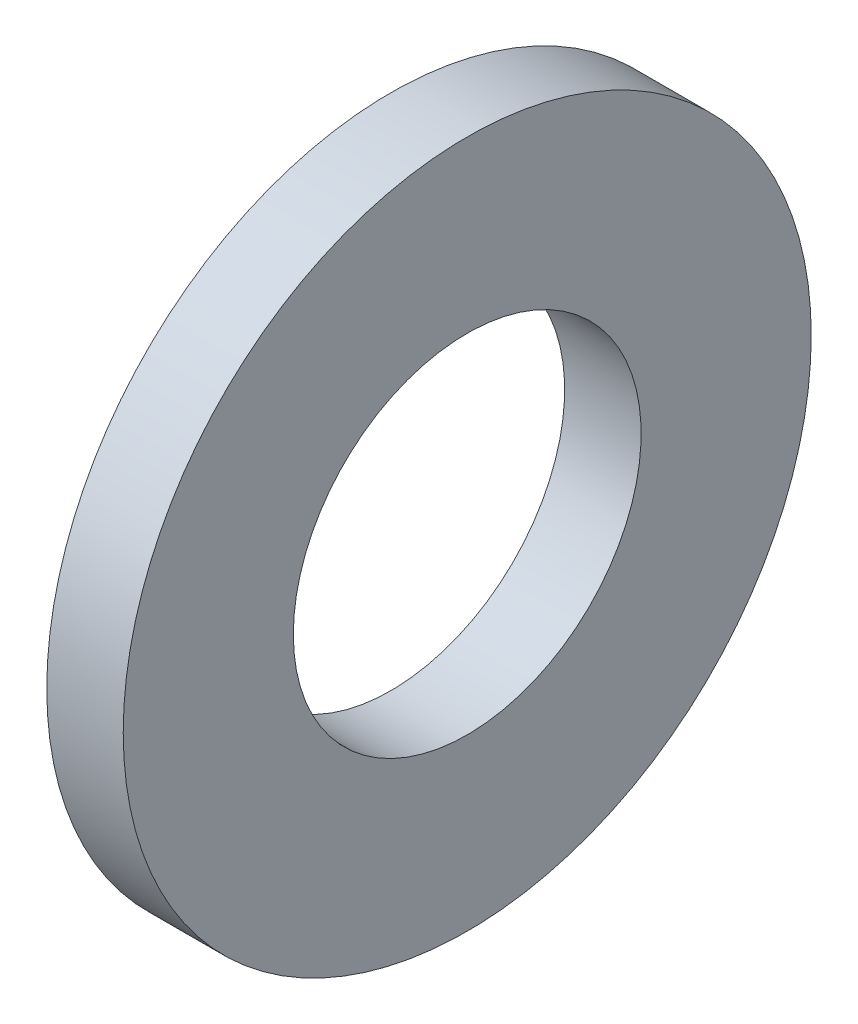
ISO-10303-21;
HEADER;
FILE_DESCRIPTION(('STEP AP214'),'2;1');
FILE_NAME('part.step','',(''),(''),'','','');
FILE_SCHEMA(('AUTOMOTIVE_DESIGN { 1 0 10303 214 1 1 1 1 }'));
ENDSEC;
DATA;
#1=APPLICATION_CONTEXT('core data for automotive mechanical design processes');
#2=APPLICATION_PROTOCOL_DEFINITION('international standard','automotive_design',2000,#1);
#3=PRODUCT_CONTEXT('',#1,'mechanical');
#4=PRODUCT('Part','Part','',(#3));
#5=PRODUCT_RELATED_PRODUCT_CATEGORY('part','',(#4));
#6=PRODUCT_DEFINITION_FORMATION('','',#4);
#7=PRODUCT_DEFINITION_CONTEXT('part definition',#1,'design');
#8=PRODUCT_DEFINITION('design','',#6,#7);
#9=PRODUCT_DEFINITION_SHAPE('','',#8);
#10=(LENGTH_UNIT() NAMED_UNIT(*) SI_UNIT(.MILLI.,.METRE.));
#11=(NAMED_UNIT(*) PLANE_ANGLE_UNIT() SI_UNIT($,.RADIAN.));
#12=(NAMED_UNIT(*) SI_UNIT($,.STERADIAN.) SOLID_ANGLE_UNIT());
#13=UNCERTAINTY_MEASURE_WITH_UNIT(LENGTH_MEASURE(1.E-05),#10,'distance_accuracy_value','');
#14=(GEOMETRIC_REPRESENTATION_CONTEXT(3) GLOBAL_UNCERTAINTY_ASSIGNED_CONTEXT((#13)) GLOBAL_UNIT_ASSIGNED_CONTEXT((#10,
#11,#12)) REPRESENTATION_CONTEXT('',''));
#15=CARTESIAN_POINT('',(0.,0.,0.));
#16=DIRECTION('',(0.,0.,1.));
#17=DIRECTION('',(1.,0.,0.));
#18=AXIS2_PLACEMENT_3D('',#15,#16,#17);
#19=CARTESIAN_POINT('',(0.,0.,0.));
#20=DIRECTION('',(1.,0.,0.));
#21=DIRECTION('',(0.,0.,-1.));
#22=AXIS2_PLACEMENT_3D('',#19,#20,#21);
#23=PLANE('',#22);
#24=CARTESIAN_POINT('',(0.,0.,0.));
#25=DIRECTION('',(-1.,0.,0.));
#26=DIRECTION('',(0.,0.,1.));
#27=AXIS2_PLACEMENT_3D('',#24,#25,#26);
#28=CIRCLE('',#27,2.275);
#29=CARTESIAN_POINT('',(0.,0.,2.275));
#30=VERTEX_POINT('',#29);
#31=EDGE_CURVE('E27',#30,#30,#28,.F.);
#32=ORIENTED_EDGE('',*,*,#31,.T.);
#33=EDGE_LOOP('',(#32));
#34=FACE_BOUND('',#33,.T.);
#35=CARTESIAN_POINT('',(0.,0.,0.));
#36=DIRECTION('',(-1.,0.,0.));
#37=DIRECTION('',(0.,0.,1.));
#38=AXIS2_PLACEMENT_3D('',#35,#36,#37);
#39=CIRCLE('',#38,4.5);
#40=CARTESIAN_POINT('',(0.,0.,4.5));
#41=VERTEX_POINT('',#40);
#42=EDGE_CURVE('E18',#41,#41,#39,.F.);
#43=ORIENTED_EDGE('',*,*,#42,.F.);
#44=EDGE_LOOP('',(#43));
#45=FACE_BOUND('',#44,.T.);
#46=ADVANCED_FACE('F15',(#34,#45),#23,.F.);
#47=CARTESIAN_POINT('',(1.,0.,0.));
#48=DIRECTION('',(-1.,0.,0.));
#49=DIRECTION('',(0.,0.,1.));
#50=AXIS2_PLACEMENT_3D('',#47,#48,#49);
#51=CYLINDRICAL_SURFACE('',#50,4.5);
#52=ORIENTED_EDGE('',*,*,#42,.T.);
#53=EDGE_LOOP('',(#52));
#54=FACE_BOUND('',#53,.T.);
#55=CARTESIAN_POINT('',(1.,0.,0.));
#56=DIRECTION('',(-1.,0.,0.));
#57=DIRECTION('',(0.,0.,1.));
#58=AXIS2_PLACEMENT_3D('',#55,#56,#57);
#59=CIRCLE('',#58,4.5);
#60=CARTESIAN_POINT('',(1.,0.,4.5));
#61=VERTEX_POINT('',#60);
#62=EDGE_CURVE('E22',#61,#61,#59,.F.);
#63=ORIENTED_EDGE('',*,*,#62,.F.);
#64=EDGE_LOOP('',(#63));
#65=FACE_BOUND('',#64,.T.);
#66=ADVANCED_FACE('F35',(#54,#65),#51,.T.);
#67=CARTESIAN_POINT('',(1.,0.,0.));
#68=DIRECTION('',(-1.,0.,0.));
#69=DIRECTION('',(0.,0.,1.));
#70=AXIS2_PLACEMENT_3D('',#67,#68,#69);
#71=CYLINDRICAL_SURFACE('',#70,2.275);
#72=CARTESIAN_POINT('',(1.,0.,0.));
#73=DIRECTION('',(-1.,0.,0.));
#74=DIRECTION('',(0.,0.,1.));
#75=AXIS2_PLACEMENT_3D('',#72,#73,#74);
#76=CIRCLE('',#75,2.275);
#77=CARTESIAN_POINT('',(1.,0.,2.275));
#78=VERTEX_POINT('',#77);
#79=EDGE_CURVE('E10',#78,#78,#76,.T.);
#80=ORIENTED_EDGE('',*,*,#79,.F.);
#81=EDGE_LOOP('',(#80));
#82=FACE_BOUND('',#81,.T.);
#83=ORIENTED_EDGE('',*,*,#31,.F.);
#84=EDGE_LOOP('',(#83));
#85=FACE_BOUND('',#84,.T.);
#86=ADVANCED_FACE('F43',(#82,#85),#71,.F.);
#87=CARTESIAN_POINT('',(1.,0.,0.));
#88=DIRECTION('',(1.,0.,0.));
#89=DIRECTION('',(0.,0.,-1.));
#90=AXIS2_PLACEMENT_3D('',#87,#88,#89);
#91=PLANE('',#90);
#92=ORIENTED_EDGE('',*,*,#79,.T.);
#93=EDGE_LOOP('',(#92));
#94=FACE_BOUND('',#93,.T.);
#95=ORIENTED_EDGE('',*,*,#62,.T.);
#96=EDGE_LOOP('',(#95));
#97=FACE_BOUND('',#96,.T.);
#98=ADVANCED_FACE('F44',(#94,#97),#91,.T.);
#99=CLOSED_SHELL('',(#46,#66,#86,#98));
#100=MANIFOLD_SOLID_BREP('B1',#99);
#101=ADVANCED_BREP_SHAPE_REPRESENTATION('',(#18,#100),#14);
#102=SHAPE_DEFINITION_REPRESENTATION(#9,#101);
ENDSEC;
END-ISO-10303-21;
